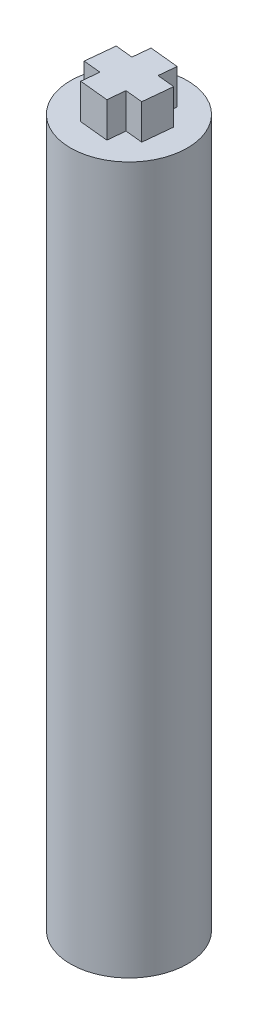
ISO-10303-21;
HEADER;
FILE_DESCRIPTION(('STEP AP214'),'2;1');
FILE_NAME('part.step','',(''),(''),'','','');
FILE_SCHEMA(('AUTOMOTIVE_DESIGN { 1 0 10303 214 1 1 1 1 }'));
ENDSEC;
DATA;
#1=APPLICATION_CONTEXT('core data for automotive mechanical design processes');
#2=APPLICATION_PROTOCOL_DEFINITION('international standard','automotive_design',2000,#1);
#3=PRODUCT_CONTEXT('',#1,'mechanical');
#4=PRODUCT('Part','Part','',(#3));
#5=PRODUCT_RELATED_PRODUCT_CATEGORY('part','',(#4));
#6=PRODUCT_DEFINITION_FORMATION('','',#4);
#7=PRODUCT_DEFINITION_CONTEXT('part definition',#1,'design');
#8=PRODUCT_DEFINITION('design','',#6,#7);
#9=PRODUCT_DEFINITION_SHAPE('','',#8);
#10=(LENGTH_UNIT() NAMED_UNIT(*) SI_UNIT(.MILLI.,.METRE.));
#11=(NAMED_UNIT(*) PLANE_ANGLE_UNIT() SI_UNIT($,.RADIAN.));
#12=(NAMED_UNIT(*) SI_UNIT($,.STERADIAN.) SOLID_ANGLE_UNIT());
#13=UNCERTAINTY_MEASURE_WITH_UNIT(LENGTH_MEASURE(1.E-05),#10,'distance_accuracy_value','');
#14=(GEOMETRIC_REPRESENTATION_CONTEXT(3) GLOBAL_UNCERTAINTY_ASSIGNED_CONTEXT((#13)) GLOBAL_UNIT_ASSIGNED_CONTEXT((#10,
#11,#12)) REPRESENTATION_CONTEXT('',''));
#15=CARTESIAN_POINT('',(0.,0.,0.));
#16=DIRECTION('',(0.,0.,1.));
#17=DIRECTION('',(1.,0.,0.));
#18=AXIS2_PLACEMENT_3D('',#15,#16,#17);
#19=CARTESIAN_POINT('',(0.,0.,0.));
#20=DIRECTION('',(0.,1.,0.));
#21=DIRECTION('',(0.,0.,1.));
#22=AXIS2_PLACEMENT_3D('',#19,#20,#21);
#23=PLANE('',#22);
#24=DIRECTION('',(-0.0952750914858848,0.,0.995450981687374));
#25=VECTOR('',#24,1.);
#26=CARTESIAN_POINT('',(2.88875972386049,0.,-1.3184842020801));
#27=LINE('',#26,#25);
#28=CARTESIAN_POINT('',(2.88875972386049,0.,-1.3184842020801));
#29=VERTEX_POINT('',#28);
#30=CARTESIAN_POINT('',(2.58622067542006,0.,1.84249720525246));
#31=VERTEX_POINT('',#30);
#32=EDGE_CURVE('E280',#29,#31,#27,.T.);
#33=ORIENTED_EDGE('',*,*,#32,.F.);
#34=DIRECTION('',(0.814448292620482,0.,0.58023614041835));
#35=VECTOR('',#34,1.);
#36=CARTESIAN_POINT('',(0.302539048440431,0.,-3.16098140733255));
#37=LINE('',#36,#35);
#38=CARTESIAN_POINT('',(0.302539048440431,0.,-3.16098140733255));
#39=VERTEX_POINT('',#38);
#40=EDGE_CURVE('E278',#39,#29,#37,.T.);
#41=ORIENTED_EDGE('',*,*,#40,.F.);
#42=DIRECTION('',(0.909723384106366,0.,-0.415214841269024));
#43=VECTOR('',#42,1.);
#44=CARTESIAN_POINT('',(-2.58622067542006,0.,-1.84249720525246));
#45=LINE('',#44,#43);
#46=CARTESIAN_POINT('',(-2.58622067542006,0.,-1.84249720525246));
#47=VERTEX_POINT('',#46);
#48=EDGE_CURVE('E292',#47,#39,#45,.T.);
#49=ORIENTED_EDGE('',*,*,#48,.F.);
#50=DIRECTION('',(0.0952750914858847,0.,-0.995450981687374));
#51=VECTOR('',#50,1.);
#52=CARTESIAN_POINT('',(-2.88875972386049,0.,1.31848420208009));
#53=LINE('',#52,#51);
#54=CARTESIAN_POINT('',(-2.88875972386049,0.,1.31848420208009));
#55=VERTEX_POINT('',#54);
#56=EDGE_CURVE('E289',#55,#47,#53,.T.);
#57=ORIENTED_EDGE('',*,*,#56,.F.);
#58=DIRECTION('',(-0.814448292620482,0.,-0.580236140418349));
#59=VECTOR('',#58,1.);
#60=CARTESIAN_POINT('',(-0.302539048440428,0.,3.16098140733255));
#61=LINE('',#60,#59);
#62=CARTESIAN_POINT('',(-0.302539048440428,0.,3.16098140733255));
#63=VERTEX_POINT('',#62);
#64=EDGE_CURVE('E286',#63,#55,#61,.T.);
#65=ORIENTED_EDGE('',*,*,#64,.F.);
#66=DIRECTION('',(-0.909723384106366,0.,0.415214841269024));
#67=VECTOR('',#66,1.);
#68=CARTESIAN_POINT('',(2.58622067542006,0.,1.84249720525246));
#69=LINE('',#68,#67);
#70=EDGE_CURVE('E283',#31,#63,#69,.T.);
#71=ORIENTED_EDGE('',*,*,#70,.F.);
#72=EDGE_LOOP('',(#33,#41,#49,#57,#65,#71));
#73=FACE_BOUND('',#72,.T.);
#74=CARTESIAN_POINT('',(0.,0.,0.));
#75=DIRECTION('',(0.,1.,0.));
#76=DIRECTION('',(0.,0.,1.));
#77=AXIS2_PLACEMENT_3D('',#74,#75,#76);
#78=CIRCLE('',#77,5.);
#79=CARTESIAN_POINT('',(0.,0.,5.));
#80=VERTEX_POINT('',#79);
#81=EDGE_CURVE('E53',#80,#80,#78,.T.);
#82=ORIENTED_EDGE('',*,*,#81,.F.);
#83=EDGE_LOOP('',(#82));
#84=FACE_BOUND('',#83,.T.);
#85=ADVANCED_FACE('F45',(#73,#84),#23,.F.);
#86=CARTESIAN_POINT('',(0.,2.,0.));
#87=DIRECTION('',(0.,-1.,0.));
#88=DIRECTION('',(0.,0.,-1.));
#89=AXIS2_PLACEMENT_3D('',#86,#87,#88);
#90=CYLINDRICAL_SURFACE('',#89,5.);
#91=ORIENTED_EDGE('',*,*,#81,.T.);
#92=EDGE_LOOP('',(#91));
#93=FACE_BOUND('',#92,.T.);
#94=CARTESIAN_POINT('',(0.,60.5,0.));
#95=DIRECTION('',(0.,1.,0.));
#96=DIRECTION('',(0.,0.,1.));
#97=AXIS2_PLACEMENT_3D('',#94,#95,#96);
#98=CIRCLE('',#97,5.);
#99=CARTESIAN_POINT('',(0.,60.5,5.));
#100=VERTEX_POINT('',#99);
#101=EDGE_CURVE('E210',#100,#100,#98,.T.);
#102=ORIENTED_EDGE('',*,*,#101,.F.);
#103=EDGE_LOOP('',(#102));
#104=FACE_BOUND('',#103,.T.);
#105=ADVANCED_FACE('F47',(#93,#104),#90,.T.);
#106=CARTESIAN_POINT('',(0.302539048440431,2.,-3.16098140733255));
#107=DIRECTION('',(0.580236140418349,0.,-0.814448292620481));
#108=DIRECTION('',(-0.814448292620481,0.,-0.580236140418349));
#109=AXIS2_PLACEMENT_3D('',#106,#107,#108);
#110=PLANE('',#109);
#111=ORIENTED_EDGE('',*,*,#40,.T.);
#112=DIRECTION('',(0.,-1.,0.));
#113=VECTOR('',#112,1.);
#114=CARTESIAN_POINT('',(2.88875972386049,2.,-1.3184842020801));
#115=LINE('',#114,#113);
#116=CARTESIAN_POINT('',(2.8887597238605,8.,-1.31848420208007));
#117=VERTEX_POINT('',#116);
#118=EDGE_CURVE('E295',#117,#29,#115,.T.);
#119=ORIENTED_EDGE('',*,*,#118,.F.);
#120=DIRECTION('',(0.814448292620477,0.,0.580236140418356));
#121=VECTOR('',#120,1.);
#122=CARTESIAN_POINT('',(0.302539048440452,8.,-3.16098140733255));
#123=LINE('',#122,#121);
#124=CARTESIAN_POINT('',(0.302539048440452,8.,-3.16098140733255));
#125=VERTEX_POINT('',#124);
#126=EDGE_CURVE('E192',#125,#117,#123,.T.);
#127=ORIENTED_EDGE('',*,*,#126,.F.);
#128=DIRECTION('',(0.,-1.,0.));
#129=VECTOR('',#128,1.);
#130=CARTESIAN_POINT('',(0.302539048440431,2.,-3.16098140733255));
#131=LINE('',#130,#129);
#132=EDGE_CURVE('E296',#125,#39,#131,.T.);
#133=ORIENTED_EDGE('',*,*,#132,.T.);
#134=EDGE_LOOP('',(#111,#119,#127,#133));
#135=FACE_BOUND('',#134,.T.);
#136=ADVANCED_FACE('F341',(#135),#110,.F.);
#137=CARTESIAN_POINT('',(-2.58622067542006,2.,-1.84249720525246));
#138=DIRECTION('',(-0.415214841269024,0.,-0.909723384106366));
#139=DIRECTION('',(-0.909723384106366,0.,0.415214841269024));
#140=AXIS2_PLACEMENT_3D('',#137,#138,#139);
#141=PLANE('',#140);
#142=ORIENTED_EDGE('',*,*,#48,.T.);
#143=ORIENTED_EDGE('',*,*,#132,.F.);
#144=DIRECTION('',(0.909723384106369,0.,-0.415214841269018));
#145=VECTOR('',#144,1.);
#146=CARTESIAN_POINT('',(-2.58622067542005,8.,-1.84249720525248));
#147=LINE('',#146,#145);
#148=CARTESIAN_POINT('',(-2.58622067542005,8.,-1.84249720525248));
#149=VERTEX_POINT('',#148);
#150=EDGE_CURVE('E207',#149,#125,#147,.T.);
#151=ORIENTED_EDGE('',*,*,#150,.F.);
#152=DIRECTION('',(0.,-1.,0.));
#153=VECTOR('',#152,1.);
#154=CARTESIAN_POINT('',(-2.58622067542006,2.,-1.84249720525246));
#155=LINE('',#154,#153);
#156=EDGE_CURVE('E299',#149,#47,#155,.T.);
#157=ORIENTED_EDGE('',*,*,#156,.T.);
#158=EDGE_LOOP('',(#142,#143,#151,#157));
#159=FACE_BOUND('',#158,.T.);
#160=ADVANCED_FACE('F394',(#159),#141,.F.);
#161=CARTESIAN_POINT('',(-2.88875972386049,2.,1.31848420208009));
#162=DIRECTION('',(-0.995450981687374,0.,-0.0952750914858847));
#163=DIRECTION('',(-0.0952750914858847,0.,0.995450981687374));
#164=AXIS2_PLACEMENT_3D('',#161,#162,#163);
#165=PLANE('',#164);
#166=ORIENTED_EDGE('',*,*,#56,.T.);
#167=ORIENTED_EDGE('',*,*,#156,.F.);
#168=DIRECTION('',(0.0952750914858919,0.,-0.995450981687373));
#169=VECTOR('',#168,1.);
#170=CARTESIAN_POINT('',(-2.8887597238605,8.,1.31848420208007));
#171=LINE('',#170,#169);
#172=CARTESIAN_POINT('',(-2.8887597238605,8.,1.31848420208007));
#173=VERTEX_POINT('',#172);
#174=EDGE_CURVE('E204',#173,#149,#171,.T.);
#175=ORIENTED_EDGE('',*,*,#174,.F.);
#176=DIRECTION('',(0.,-1.,0.));
#177=VECTOR('',#176,1.);
#178=CARTESIAN_POINT('',(-2.88875972386049,2.,1.31848420208009));
#179=LINE('',#178,#177);
#180=EDGE_CURVE('E301',#173,#55,#179,.T.);
#181=ORIENTED_EDGE('',*,*,#180,.T.);
#182=EDGE_LOOP('',(#166,#167,#175,#181));
#183=FACE_BOUND('',#182,.T.);
#184=ADVANCED_FACE('F408',(#183),#165,.F.);
#185=CARTESIAN_POINT('',(-0.302539048440428,2.,3.16098140733255));
#186=DIRECTION('',(-0.580236140418349,0.,0.814448292620482));
#187=DIRECTION('',(0.814448292620482,0.,0.580236140418349));
#188=AXIS2_PLACEMENT_3D('',#185,#186,#187);
#189=PLANE('',#188);
#190=ORIENTED_EDGE('',*,*,#64,.T.);
#191=ORIENTED_EDGE('',*,*,#180,.F.);
#192=DIRECTION('',(-0.814448292620477,0.,-0.580236140418356));
#193=VECTOR('',#192,1.);
#194=CARTESIAN_POINT('',(-0.302539048440453,8.,3.16098140733255));
#195=LINE('',#194,#193);
#196=CARTESIAN_POINT('',(-0.302539048440453,8.,3.16098140733255));
#197=VERTEX_POINT('',#196);
#198=EDGE_CURVE('E201',#197,#173,#195,.T.);
#199=ORIENTED_EDGE('',*,*,#198,.F.);
#200=DIRECTION('',(0.,-1.,0.));
#201=VECTOR('',#200,1.);
#202=CARTESIAN_POINT('',(-0.302539048440428,2.,3.16098140733255));
#203=LINE('',#202,#201);
#204=EDGE_CURVE('E303',#197,#63,#203,.T.);
#205=ORIENTED_EDGE('',*,*,#204,.T.);
#206=EDGE_LOOP('',(#190,#191,#199,#205));
#207=FACE_BOUND('',#206,.T.);
#208=ADVANCED_FACE('F404',(#207),#189,.F.);
#209=CARTESIAN_POINT('',(2.58622067542006,2.,1.84249720525246));
#210=DIRECTION('',(0.415214841269024,0.,0.909723384106366));
#211=DIRECTION('',(0.909723384106366,0.,-0.415214841269024));
#212=AXIS2_PLACEMENT_3D('',#209,#210,#211);
#213=PLANE('',#212);
#214=ORIENTED_EDGE('',*,*,#70,.T.);
#215=ORIENTED_EDGE('',*,*,#204,.F.);
#216=DIRECTION('',(-0.909723384106369,0.,0.415214841269018));
#217=VECTOR('',#216,1.);
#218=CARTESIAN_POINT('',(2.58622067542005,8.,1.84249720525248));
#219=LINE('',#218,#217);
#220=CARTESIAN_POINT('',(2.58622067542005,8.,1.84249720525248));
#221=VERTEX_POINT('',#220);
#222=EDGE_CURVE('E198',#221,#197,#219,.T.);
#223=ORIENTED_EDGE('',*,*,#222,.F.);
#224=DIRECTION('',(0.,-1.,0.));
#225=VECTOR('',#224,1.);
#226=CARTESIAN_POINT('',(2.58622067542006,2.,1.84249720525246));
#227=LINE('',#226,#225);
#228=EDGE_CURVE('E305',#221,#31,#227,.T.);
#229=ORIENTED_EDGE('',*,*,#228,.T.);
#230=EDGE_LOOP('',(#214,#215,#223,#229));
#231=FACE_BOUND('',#230,.T.);
#232=ADVANCED_FACE('F400',(#231),#213,.F.);
#233=CARTESIAN_POINT('',(2.88875972386049,2.,-1.3184842020801));
#234=DIRECTION('',(0.995450981687374,0.,0.0952750914858848));
#235=DIRECTION('',(0.0952750914858848,0.,-0.995450981687374));
#236=AXIS2_PLACEMENT_3D('',#233,#234,#235);
#237=PLANE('',#236);
#238=ORIENTED_EDGE('',*,*,#32,.T.);
#239=ORIENTED_EDGE('',*,*,#228,.F.);
#240=DIRECTION('',(-0.0952750914858923,0.,0.995450981687373));
#241=VECTOR('',#240,1.);
#242=CARTESIAN_POINT('',(2.8887597238605,8.,-1.31848420208007));
#243=LINE('',#242,#241);
#244=EDGE_CURVE('E195',#117,#221,#243,.T.);
#245=ORIENTED_EDGE('',*,*,#244,.F.);
#246=ORIENTED_EDGE('',*,*,#118,.T.);
#247=EDGE_LOOP('',(#238,#239,#245,#246));
#248=FACE_BOUND('',#247,.T.);
#249=ADVANCED_FACE('F396',(#248),#237,.F.);
#250=CARTESIAN_POINT('',(0.,60.5,0.));
#251=DIRECTION('',(0.,1.,0.));
#252=DIRECTION('',(0.,0.,1.));
#253=AXIS2_PLACEMENT_3D('',#250,#251,#252);
#254=PLANE('',#253);
#255=DIRECTION('',(0.994982427707565,0.,0.10004983035048));
#256=VECTOR('',#255,1.);
#257=CARTESIAN_POINT('',(-2.6111393882577,60.5,-1.51886506809828));
#258=LINE('',#257,#256);
#259=CARTESIAN_POINT('',(-2.6111393882577,60.5,-1.51886506809828));
#260=VERTEX_POINT('',#259);
#261=CARTESIAN_POINT('',(-1.11866574669637,60.5,-1.36879032257256));
#262=VERTEX_POINT('',#261);
#263=EDGE_CURVE('E12',#260,#262,#258,.T.);
#264=ORIENTED_EDGE('',*,*,#263,.T.);
#265=DIRECTION('',(0.100049830350469,0.,-0.994982427707566));
#266=VECTOR('',#265,1.);
#267=CARTESIAN_POINT('',(-1.09365328910875,60.5,-1.61753592949944));
#268=LINE('',#267,#266);
#269=CARTESIAN_POINT('',(-0.968591001170667,60.5,-2.86126396413389));
#270=VERTEX_POINT('',#269);
#271=EDGE_CURVE('E239',#262,#270,#268,.T.);
#272=ORIENTED_EDGE('',*,*,#271,.T.);
#273=DIRECTION('',(0.994982427707566,0.,0.100049830350469));
#274=VECTOR('',#273,1.);
#275=CARTESIAN_POINT('',(-0.968591001170667,60.5,-2.86126396413389));
#276=LINE('',#275,#274);
#277=CARTESIAN_POINT('',(1.51886506809825,60.5,-2.61113938825772));
#278=VERTEX_POINT('',#277);
#279=EDGE_CURVE('E60',#270,#278,#276,.T.);
#280=ORIENTED_EDGE('',*,*,#279,.T.);
#281=DIRECTION('',(-0.10004983035047,0.,0.994982427707566));
#282=VECTOR('',#281,1.);
#283=CARTESIAN_POINT('',(1.51886506809825,60.5,-2.61113938825772));
#284=LINE('',#283,#282);
#285=CARTESIAN_POINT('',(1.36879032257255,60.5,-1.11866574669637));
#286=VERTEX_POINT('',#285);
#287=EDGE_CURVE('E68',#278,#286,#284,.T.);
#288=ORIENTED_EDGE('',*,*,#287,.T.);
#289=DIRECTION('',(0.994982427707564,0.,0.100049830350493));
#290=VECTOR('',#289,1.);
#291=CARTESIAN_POINT('',(1.61753592949944,60.5,-1.09365328910875));
#292=LINE('',#291,#290);
#293=CARTESIAN_POINT('',(2.8612639641339,60.5,-0.968591001170657));
#294=VERTEX_POINT('',#293);
#295=EDGE_CURVE('E234',#286,#294,#292,.T.);
#296=ORIENTED_EDGE('',*,*,#295,.T.);
#297=DIRECTION('',(-0.100049830350473,0.,0.994982427707566));
#298=VECTOR('',#297,1.);
#299=CARTESIAN_POINT('',(2.8612639641339,60.5,-0.968591001170657));
#300=LINE('',#299,#298);
#301=CARTESIAN_POINT('',(2.61113938825772,60.5,1.51886506809826));
#302=VERTEX_POINT('',#301);
#303=EDGE_CURVE('E231',#294,#302,#300,.T.);
#304=ORIENTED_EDGE('',*,*,#303,.T.);
#305=DIRECTION('',(-0.994982427707566,0.,-0.100049830350473));
#306=VECTOR('',#305,1.);
#307=CARTESIAN_POINT('',(2.61113938825772,60.5,1.51886506809826));
#308=LINE('',#307,#306);
#309=CARTESIAN_POINT('',(1.11866574669637,60.5,1.36879032257255));
#310=VERTEX_POINT('',#309);
#311=EDGE_CURVE('E228',#302,#310,#308,.T.);
#312=ORIENTED_EDGE('',*,*,#311,.T.);
#313=DIRECTION('',(-0.100049830350497,0.,0.994982427707564));
#314=VECTOR('',#313,1.);
#315=CARTESIAN_POINT('',(1.09365328910874,60.5,1.61753592949944));
#316=LINE('',#315,#314);
#317=CARTESIAN_POINT('',(0.968591001170647,60.5,2.8612639641339));
#318=VERTEX_POINT('',#317);
#319=EDGE_CURVE('E225',#310,#318,#316,.T.);
#320=ORIENTED_EDGE('',*,*,#319,.T.);
#321=DIRECTION('',(-0.994982427707566,0.,-0.100049830350476));
#322=VECTOR('',#321,1.);
#323=CARTESIAN_POINT('',(0.968591001170647,60.5,2.8612639641339));
#324=LINE('',#323,#322);
#325=CARTESIAN_POINT('',(-1.51886506809827,60.5,2.61113938825771));
#326=VERTEX_POINT('',#325);
#327=EDGE_CURVE('E222',#318,#326,#324,.T.);
#328=ORIENTED_EDGE('',*,*,#327,.T.);
#329=DIRECTION('',(0.100049830350477,0.,-0.994982427707566));
#330=VECTOR('',#329,1.);
#331=CARTESIAN_POINT('',(-1.51886506809827,60.5,2.61113938825771));
#332=LINE('',#331,#330);
#333=CARTESIAN_POINT('',(-1.36879032257255,60.5,1.11866574669636));
#334=VERTEX_POINT('',#333);
#335=EDGE_CURVE('E219',#326,#334,#332,.T.);
#336=ORIENTED_EDGE('',*,*,#335,.T.);
#337=DIRECTION('',(-0.994982427707563,0.,-0.1000498303505));
#338=VECTOR('',#337,1.);
#339=CARTESIAN_POINT('',(-1.61753592949945,60.5,1.09365328910874));
#340=LINE('',#339,#338);
#341=CARTESIAN_POINT('',(-2.8612639641339,60.5,0.968591001170637));
#342=VERTEX_POINT('',#341);
#343=EDGE_CURVE('E216',#334,#342,#340,.T.);
#344=ORIENTED_EDGE('',*,*,#343,.T.);
#345=DIRECTION('',(0.10004983035048,0.,-0.994982427707565));
#346=VECTOR('',#345,1.);
#347=CARTESIAN_POINT('',(-2.8612639641339,60.5,0.968591001170637));
#348=LINE('',#347,#346);
#349=EDGE_CURVE('E213',#342,#260,#348,.T.);
#350=ORIENTED_EDGE('',*,*,#349,.T.);
#351=EDGE_LOOP('',(#264,#272,#280,#288,#296,#304,#312,#320,#328,#336,#344,#350));
#352=FACE_BOUND('',#351,.T.);
#353=ORIENTED_EDGE('',*,*,#101,.T.);
#354=EDGE_LOOP('',(#353));
#355=FACE_BOUND('',#354,.T.);
#356=ADVANCED_FACE('F399',(#352,#355),#254,.T.);
#357=CARTESIAN_POINT('',(0.,63.5,0.));
#358=DIRECTION('',(0.,1.,0.));
#359=DIRECTION('',(0.,0.,1.));
#360=AXIS2_PLACEMENT_3D('',#357,#358,#359);
#361=PLANE('',#360);
#362=DIRECTION('',(-0.994982427707565,0.,-0.10004983035048));
#363=VECTOR('',#362,1.);
#364=CARTESIAN_POINT('',(-2.6111393882577,63.5,-1.51886506809828));
#365=LINE('',#364,#363);
#366=CARTESIAN_POINT('',(-1.11866574669637,63.5,-1.36879032257256));
#367=VERTEX_POINT('',#366);
#368=CARTESIAN_POINT('',(-2.6111393882577,63.5,-1.51886506809828));
#369=VERTEX_POINT('',#368);
#370=EDGE_CURVE('E242',#367,#369,#365,.T.);
#371=ORIENTED_EDGE('',*,*,#370,.T.);
#372=DIRECTION('',(-0.10004983035048,0.,0.994982427707565));
#373=VECTOR('',#372,1.);
#374=CARTESIAN_POINT('',(-2.8612639641339,63.5,0.968591001170637));
#375=LINE('',#374,#373);
#376=CARTESIAN_POINT('',(-2.8612639641339,63.5,0.968591001170637));
#377=VERTEX_POINT('',#376);
#378=EDGE_CURVE('E245',#369,#377,#375,.T.);
#379=ORIENTED_EDGE('',*,*,#378,.T.);
#380=DIRECTION('',(0.994982427707565,0.,0.100049830350483));
#381=VECTOR('',#380,1.);
#382=CARTESIAN_POINT('',(-1.36879032257255,63.5,1.11866574669636));
#383=LINE('',#382,#381);
#384=CARTESIAN_POINT('',(-1.36879032257255,63.5,1.11866574669636));
#385=VERTEX_POINT('',#384);
#386=EDGE_CURVE('E248',#377,#385,#383,.T.);
#387=ORIENTED_EDGE('',*,*,#386,.T.);
#388=DIRECTION('',(-0.100049830350477,0.,0.994982427707566));
#389=VECTOR('',#388,1.);
#390=CARTESIAN_POINT('',(-1.51886506809827,63.5,2.61113938825771));
#391=LINE('',#390,#389);
#392=CARTESIAN_POINT('',(-1.51886506809827,63.5,2.61113938825771));
#393=VERTEX_POINT('',#392);
#394=EDGE_CURVE('E251',#385,#393,#391,.T.);
#395=ORIENTED_EDGE('',*,*,#394,.T.);
#396=DIRECTION('',(0.994982427707566,0.,0.100049830350476));
#397=VECTOR('',#396,1.);
#398=CARTESIAN_POINT('',(0.968591001170647,63.5,2.8612639641339));
#399=LINE('',#398,#397);
#400=CARTESIAN_POINT('',(0.968591001170647,63.5,2.8612639641339));
#401=VERTEX_POINT('',#400);
#402=EDGE_CURVE('E254',#393,#401,#399,.T.);
#403=ORIENTED_EDGE('',*,*,#402,.T.);
#404=DIRECTION('',(0.100049830350479,0.,-0.994982427707565));
#405=VECTOR('',#404,1.);
#406=CARTESIAN_POINT('',(1.11866574669637,63.5,1.36879032257255));
#407=LINE('',#406,#405);
#408=CARTESIAN_POINT('',(1.11866574669637,63.5,1.36879032257255));
#409=VERTEX_POINT('',#408);
#410=EDGE_CURVE('E257',#401,#409,#407,.T.);
#411=ORIENTED_EDGE('',*,*,#410,.T.);
#412=DIRECTION('',(0.994982427707566,0.,0.100049830350473));
#413=VECTOR('',#412,1.);
#414=CARTESIAN_POINT('',(2.61113938825772,63.5,1.51886506809826));
#415=LINE('',#414,#413);
#416=CARTESIAN_POINT('',(2.61113938825772,63.5,1.51886506809826));
#417=VERTEX_POINT('',#416);
#418=EDGE_CURVE('E260',#409,#417,#415,.T.);
#419=ORIENTED_EDGE('',*,*,#418,.T.);
#420=DIRECTION('',(0.100049830350473,0.,-0.994982427707566));
#421=VECTOR('',#420,1.);
#422=CARTESIAN_POINT('',(2.8612639641339,63.5,-0.968591001170657));
#423=LINE('',#422,#421);
#424=CARTESIAN_POINT('',(2.8612639641339,63.5,-0.968591001170657));
#425=VERTEX_POINT('',#424);
#426=EDGE_CURVE('E263',#417,#425,#423,.T.);
#427=ORIENTED_EDGE('',*,*,#426,.T.);
#428=DIRECTION('',(-0.994982427707566,0.,-0.100049830350476));
#429=VECTOR('',#428,1.);
#430=CARTESIAN_POINT('',(1.36879032257255,63.5,-1.11866574669637));
#431=LINE('',#430,#429);
#432=CARTESIAN_POINT('',(1.36879032257255,63.5,-1.11866574669637));
#433=VERTEX_POINT('',#432);
#434=EDGE_CURVE('E266',#425,#433,#431,.T.);
#435=ORIENTED_EDGE('',*,*,#434,.T.);
#436=DIRECTION('',(0.10004983035047,0.,-0.994982427707566));
#437=VECTOR('',#436,1.);
#438=CARTESIAN_POINT('',(1.51886506809825,63.5,-2.61113938825772));
#439=LINE('',#438,#437);
#440=CARTESIAN_POINT('',(1.51886506809825,63.5,-2.61113938825772));
#441=VERTEX_POINT('',#440);
#442=EDGE_CURVE('E269',#433,#441,#439,.T.);
#443=ORIENTED_EDGE('',*,*,#442,.T.);
#444=DIRECTION('',(-0.994982427707566,0.,-0.100049830350469));
#445=VECTOR('',#444,1.);
#446=CARTESIAN_POINT('',(-0.968591001170667,63.5,-2.86126396413389));
#447=LINE('',#446,#445);
#448=CARTESIAN_POINT('',(-0.968591001170667,63.5,-2.86126396413389));
#449=VERTEX_POINT('',#448);
#450=EDGE_CURVE('E272',#441,#449,#447,.T.);
#451=ORIENTED_EDGE('',*,*,#450,.T.);
#452=DIRECTION('',(-0.10004983035047,0.,0.994982427707566));
#453=VECTOR('',#452,1.);
#454=CARTESIAN_POINT('',(-1.11866574669637,63.5,-1.36879032257256));
#455=LINE('',#454,#453);
#456=EDGE_CURVE('E275',#449,#367,#455,.T.);
#457=ORIENTED_EDGE('',*,*,#456,.T.);
#458=EDGE_LOOP('',(#371,#379,#387,#395,#403,#411,#419,#427,#435,#443,#451,#457));
#459=FACE_BOUND('',#458,.T.);
#460=ADVANCED_FACE('F348',(#459),#361,.T.);
#461=CARTESIAN_POINT('',(-2.6111393882577,2.5,-1.51886506809828));
#462=DIRECTION('',(0.10004983035048,0.,-0.994982427707565));
#463=DIRECTION('',(-0.994982427707565,0.,-0.10004983035048));
#464=AXIS2_PLACEMENT_3D('',#461,#462,#463);
#465=PLANE('',#464);
#466=ORIENTED_EDGE('',*,*,#263,.F.);
#467=DIRECTION('',(0.,1.,0.));
#468=VECTOR('',#467,1.);
#469=CARTESIAN_POINT('',(-2.6111393882577,2.5,-1.51886506809828));
#470=LINE('',#469,#468);
#471=EDGE_CURVE('E329',#260,#369,#470,.T.);
#472=ORIENTED_EDGE('',*,*,#471,.T.);
#473=ORIENTED_EDGE('',*,*,#370,.F.);
#474=DIRECTION('',(0.,1.,0.));
#475=VECTOR('',#474,1.);
#476=CARTESIAN_POINT('',(-1.11866574669637,2.5,-1.36879032257254));
#477=LINE('',#476,#475);
#478=EDGE_CURVE('E298',#262,#367,#477,.T.);
#479=ORIENTED_EDGE('',*,*,#478,.F.);
#480=EDGE_LOOP('',(#466,#472,#473,#479));
#481=FACE_BOUND('',#480,.T.);
#482=ADVANCED_FACE('F344',(#481),#465,.T.);
#483=CARTESIAN_POINT('',(-2.8612639641339,2.5,0.968591001170637));
#484=DIRECTION('',(-0.994982427707565,0.,-0.10004983035048));
#485=DIRECTION('',(-0.10004983035048,0.,0.994982427707565));
#486=AXIS2_PLACEMENT_3D('',#483,#484,#485);
#487=PLANE('',#486);
#488=ORIENTED_EDGE('',*,*,#349,.F.);
#489=DIRECTION('',(0.,1.,0.));
#490=VECTOR('',#489,1.);
#491=CARTESIAN_POINT('',(-2.8612639641339,2.5,0.968591001170637));
#492=LINE('',#491,#490);
#493=EDGE_CURVE('E327',#342,#377,#492,.T.);
#494=ORIENTED_EDGE('',*,*,#493,.T.);
#495=ORIENTED_EDGE('',*,*,#378,.F.);
#496=ORIENTED_EDGE('',*,*,#471,.F.);
#497=EDGE_LOOP('',(#488,#494,#495,#496));
#498=FACE_BOUND('',#497,.T.);
#499=ADVANCED_FACE('F347',(#498),#487,.T.);
#500=CARTESIAN_POINT('',(-1.61753592949945,2.5,1.09365328910874));
#501=DIRECTION('',(-0.1000498303505,0.,0.994982427707563));
#502=DIRECTION('',(0.994982427707563,0.,0.1000498303505));
#503=AXIS2_PLACEMENT_3D('',#500,#501,#502);
#504=PLANE('',#503);
#505=ORIENTED_EDGE('',*,*,#343,.F.);
#506=DIRECTION('',(0.,1.,0.));
#507=VECTOR('',#506,1.);
#508=CARTESIAN_POINT('',(-1.36879032257255,2.5,1.11866574669636));
#509=LINE('',#508,#507);
#510=EDGE_CURVE('E325',#334,#385,#509,.T.);
#511=ORIENTED_EDGE('',*,*,#510,.T.);
#512=ORIENTED_EDGE('',*,*,#386,.F.);
#513=ORIENTED_EDGE('',*,*,#493,.F.);
#514=EDGE_LOOP('',(#505,#511,#512,#513));
#515=FACE_BOUND('',#514,.T.);
#516=ADVANCED_FACE('F352',(#515),#504,.T.);
#517=CARTESIAN_POINT('',(-1.51886506809827,2.5,2.61113938825771));
#518=DIRECTION('',(-0.994982427707566,0.,-0.100049830350477));
#519=DIRECTION('',(-0.100049830350477,0.,0.994982427707566));
#520=AXIS2_PLACEMENT_3D('',#517,#518,#519);
#521=PLANE('',#520);
#522=ORIENTED_EDGE('',*,*,#335,.F.);
#523=DIRECTION('',(0.,1.,0.));
#524=VECTOR('',#523,1.);
#525=CARTESIAN_POINT('',(-1.51886506809827,2.5,2.61113938825771));
#526=LINE('',#525,#524);
#527=EDGE_CURVE('E323',#326,#393,#526,.T.);
#528=ORIENTED_EDGE('',*,*,#527,.T.);
#529=ORIENTED_EDGE('',*,*,#394,.F.);
#530=ORIENTED_EDGE('',*,*,#510,.F.);
#531=EDGE_LOOP('',(#522,#528,#529,#530));
#532=FACE_BOUND('',#531,.T.);
#533=ADVANCED_FACE('F356',(#532),#521,.T.);
#534=CARTESIAN_POINT('',(0.968591001170647,2.5,2.8612639641339));
#535=DIRECTION('',(-0.100049830350476,0.,0.994982427707566));
#536=DIRECTION('',(0.994982427707566,0.,0.100049830350476));
#537=AXIS2_PLACEMENT_3D('',#534,#535,#536);
#538=PLANE('',#537);
#539=ORIENTED_EDGE('',*,*,#327,.F.);
#540=DIRECTION('',(0.,1.,0.));
#541=VECTOR('',#540,1.);
#542=CARTESIAN_POINT('',(0.968591001170647,2.5,2.8612639641339));
#543=LINE('',#542,#541);
#544=EDGE_CURVE('E321',#318,#401,#543,.T.);
#545=ORIENTED_EDGE('',*,*,#544,.T.);
#546=ORIENTED_EDGE('',*,*,#402,.F.);
#547=ORIENTED_EDGE('',*,*,#527,.F.);
#548=EDGE_LOOP('',(#539,#545,#546,#547));
#549=FACE_BOUND('',#548,.T.);
#550=ADVANCED_FACE('F360',(#549),#538,.T.);
#551=CARTESIAN_POINT('',(1.09365328910874,2.5,1.61753592949944));
#552=DIRECTION('',(0.994982427707563,0.,0.100049830350497));
#553=DIRECTION('',(0.100049830350497,0.,-0.994982427707564));
#554=AXIS2_PLACEMENT_3D('',#551,#552,#553);
#555=PLANE('',#554);
#556=ORIENTED_EDGE('',*,*,#319,.F.);
#557=DIRECTION('',(0.,1.,0.));
#558=VECTOR('',#557,1.);
#559=CARTESIAN_POINT('',(1.11866574669637,2.5,1.36879032257255));
#560=LINE('',#559,#558);
#561=EDGE_CURVE('E319',#310,#409,#560,.T.);
#562=ORIENTED_EDGE('',*,*,#561,.T.);
#563=ORIENTED_EDGE('',*,*,#410,.F.);
#564=ORIENTED_EDGE('',*,*,#544,.F.);
#565=EDGE_LOOP('',(#556,#562,#563,#564));
#566=FACE_BOUND('',#565,.T.);
#567=ADVANCED_FACE('F364',(#566),#555,.T.);
#568=CARTESIAN_POINT('',(2.61113938825772,2.5,1.51886506809826));
#569=DIRECTION('',(-0.100049830350473,0.,0.994982427707566));
#570=DIRECTION('',(0.994982427707566,0.,0.100049830350473));
#571=AXIS2_PLACEMENT_3D('',#568,#569,#570);
#572=PLANE('',#571);
#573=ORIENTED_EDGE('',*,*,#311,.F.);
#574=DIRECTION('',(0.,1.,0.));
#575=VECTOR('',#574,1.);
#576=CARTESIAN_POINT('',(2.61113938825772,2.5,1.51886506809826));
#577=LINE('',#576,#575);
#578=EDGE_CURVE('E317',#302,#417,#577,.T.);
#579=ORIENTED_EDGE('',*,*,#578,.T.);
#580=ORIENTED_EDGE('',*,*,#418,.F.);
#581=ORIENTED_EDGE('',*,*,#561,.F.);
#582=EDGE_LOOP('',(#573,#579,#580,#581));
#583=FACE_BOUND('',#582,.T.);
#584=ADVANCED_FACE('F368',(#583),#572,.T.);
#585=CARTESIAN_POINT('',(2.8612639641339,2.5,-0.968591001170657));
#586=DIRECTION('',(0.994982427707566,0.,0.100049830350473));
#587=DIRECTION('',(0.100049830350473,0.,-0.994982427707566));
#588=AXIS2_PLACEMENT_3D('',#585,#586,#587);
#589=PLANE('',#588);
#590=ORIENTED_EDGE('',*,*,#303,.F.);
#591=DIRECTION('',(0.,1.,0.));
#592=VECTOR('',#591,1.);
#593=CARTESIAN_POINT('',(2.8612639641339,2.5,-0.968591001170657));
#594=LINE('',#593,#592);
#595=EDGE_CURVE('E315',#294,#425,#594,.T.);
#596=ORIENTED_EDGE('',*,*,#595,.T.);
#597=ORIENTED_EDGE('',*,*,#426,.F.);
#598=ORIENTED_EDGE('',*,*,#578,.F.);
#599=EDGE_LOOP('',(#590,#596,#597,#598));
#600=FACE_BOUND('',#599,.T.);
#601=ADVANCED_FACE('F372',(#600),#589,.T.);
#602=CARTESIAN_POINT('',(1.61753592949944,2.5,-1.09365328910875));
#603=DIRECTION('',(0.100049830350493,0.,-0.994982427707564));
#604=DIRECTION('',(-0.994982427707564,0.,-0.100049830350493));
#605=AXIS2_PLACEMENT_3D('',#602,#603,#604);
#606=PLANE('',#605);
#607=ORIENTED_EDGE('',*,*,#295,.F.);
#608=DIRECTION('',(0.,1.,0.));
#609=VECTOR('',#608,1.);
#610=CARTESIAN_POINT('',(1.36879032257255,2.5,-1.11866574669637));
#611=LINE('',#610,#609);
#612=EDGE_CURVE('E313',#286,#433,#611,.T.);
#613=ORIENTED_EDGE('',*,*,#612,.T.);
#614=ORIENTED_EDGE('',*,*,#434,.F.);
#615=ORIENTED_EDGE('',*,*,#595,.F.);
#616=EDGE_LOOP('',(#607,#613,#614,#615));
#617=FACE_BOUND('',#616,.T.);
#618=ADVANCED_FACE('F376',(#617),#606,.T.);
#619=CARTESIAN_POINT('',(1.51886506809825,2.5,-2.61113938825772));
#620=DIRECTION('',(0.994982427707566,0.,0.10004983035047));
#621=DIRECTION('',(0.10004983035047,0.,-0.994982427707566));
#622=AXIS2_PLACEMENT_3D('',#619,#620,#621);
#623=PLANE('',#622);
#624=ORIENTED_EDGE('',*,*,#287,.F.);
#625=DIRECTION('',(0.,1.,0.));
#626=VECTOR('',#625,1.);
#627=CARTESIAN_POINT('',(1.51886506809825,2.5,-2.61113938825772));
#628=LINE('',#627,#626);
#629=EDGE_CURVE('E311',#278,#441,#628,.T.);
#630=ORIENTED_EDGE('',*,*,#629,.T.);
#631=ORIENTED_EDGE('',*,*,#442,.F.);
#632=ORIENTED_EDGE('',*,*,#612,.F.);
#633=EDGE_LOOP('',(#624,#630,#631,#632));
#634=FACE_BOUND('',#633,.T.);
#635=ADVANCED_FACE('F380',(#634),#623,.T.);
#636=CARTESIAN_POINT('',(-0.968591001170667,2.5,-2.86126396413389));
#637=DIRECTION('',(0.100049830350469,0.,-0.994982427707566));
#638=DIRECTION('',(-0.994982427707566,0.,-0.100049830350469));
#639=AXIS2_PLACEMENT_3D('',#636,#637,#638);
#640=PLANE('',#639);
#641=ORIENTED_EDGE('',*,*,#279,.F.);
#642=DIRECTION('',(0.,1.,0.));
#643=VECTOR('',#642,1.);
#644=CARTESIAN_POINT('',(-0.968591001170667,2.5,-2.86126396413389));
#645=LINE('',#644,#643);
#646=EDGE_CURVE('E309',#270,#449,#645,.T.);
#647=ORIENTED_EDGE('',*,*,#646,.T.);
#648=ORIENTED_EDGE('',*,*,#450,.F.);
#649=ORIENTED_EDGE('',*,*,#629,.F.);
#650=EDGE_LOOP('',(#641,#647,#648,#649));
#651=FACE_BOUND('',#650,.T.);
#652=ADVANCED_FACE('F384',(#651),#640,.T.);
#653=CARTESIAN_POINT('',(-1.09365328910875,2.5,-1.61753592949944));
#654=DIRECTION('',(-0.994982427707566,0.,-0.100049830350469));
#655=DIRECTION('',(-0.100049830350469,0.,0.994982427707566));
#656=AXIS2_PLACEMENT_3D('',#653,#654,#655);
#657=PLANE('',#656);
#658=ORIENTED_EDGE('',*,*,#271,.F.);
#659=ORIENTED_EDGE('',*,*,#478,.T.);
#660=ORIENTED_EDGE('',*,*,#456,.F.);
#661=ORIENTED_EDGE('',*,*,#646,.F.);
#662=EDGE_LOOP('',(#658,#659,#660,#661));
#663=FACE_BOUND('',#662,.T.);
#664=ADVANCED_FACE('F387',(#663),#657,.T.);
#665=CARTESIAN_POINT('',(0.,8.,0.));
#666=DIRECTION('',(0.,-1.,0.));
#667=DIRECTION('',(0.,0.,-1.));
#668=AXIS2_PLACEMENT_3D('',#665,#666,#667);
#669=PLANE('',#668);
#670=CARTESIAN_POINT('',(0.,8.,0.));
#671=DIRECTION('',(0.,-1.,0.));
#672=DIRECTION('',(0.,0.,-1.));
#673=AXIS2_PLACEMENT_3D('',#670,#671,#672);
#674=CIRCLE('',#673,1.5);
#675=CARTESIAN_POINT('',(0.,8.,-1.5));
#676=VERTEX_POINT('',#675);
#677=EDGE_CURVE('E189',#676,#676,#674,.T.);
#678=ORIENTED_EDGE('',*,*,#677,.F.);
#679=EDGE_LOOP('',(#678));
#680=FACE_BOUND('',#679,.T.);
#681=ORIENTED_EDGE('',*,*,#126,.T.);
#682=ORIENTED_EDGE('',*,*,#244,.T.);
#683=ORIENTED_EDGE('',*,*,#222,.T.);
#684=ORIENTED_EDGE('',*,*,#198,.T.);
#685=ORIENTED_EDGE('',*,*,#174,.T.);
#686=ORIENTED_EDGE('',*,*,#150,.T.);
#687=EDGE_LOOP('',(#681,#682,#683,#684,#685,#686));
#688=FACE_BOUND('',#687,.T.);
#689=ADVANCED_FACE('F390',(#680,#688),#669,.T.);
#690=CARTESIAN_POINT('',(0.,23.,0.));
#691=DIRECTION('',(0.,-1.,0.));
#692=DIRECTION('',(0.,0.,-1.));
#693=AXIS2_PLACEMENT_3D('',#690,#691,#692);
#694=CYLINDRICAL_SURFACE('',#693,1.5);
#695=CARTESIAN_POINT('',(0.,23.,0.));
#696=DIRECTION('',(0.,-1.,0.));
#697=DIRECTION('',(0.,0.,-1.));
#698=AXIS2_PLACEMENT_3D('',#695,#696,#697);
#699=CIRCLE('',#698,1.5);
#700=CARTESIAN_POINT('',(0.,23.,-1.5));
#701=VERTEX_POINT('',#700);
#702=EDGE_CURVE('E184',#701,#701,#699,.F.);
#703=ORIENTED_EDGE('',*,*,#702,.T.);
#704=EDGE_LOOP('',(#703));
#705=FACE_BOUND('',#704,.T.);
#706=ORIENTED_EDGE('',*,*,#677,.T.);
#707=EDGE_LOOP('',(#706));
#708=FACE_BOUND('',#707,.T.);
#709=ADVANCED_FACE('F424',(#705,#708),#694,.F.);
#710=CARTESIAN_POINT('',(0.,23.,0.));
#711=DIRECTION('',(0.,-1.,0.));
#712=DIRECTION('',(0.,0.,-1.));
#713=AXIS2_PLACEMENT_3D('',#710,#711,#712);
#714=PLANE('',#713);
#715=CARTESIAN_POINT('',(0.,23.,0.));
#716=DIRECTION('',(0.,-1.,0.));
#717=DIRECTION('',(0.,0.,-1.));
#718=AXIS2_PLACEMENT_3D('',#715,#716,#717);
#719=CIRCLE('',#718,3.5);
#720=CARTESIAN_POINT('',(0.,23.,-3.5));
#721=VERTEX_POINT('',#720);
#722=EDGE_CURVE('E181',#721,#721,#719,.T.);
#723=ORIENTED_EDGE('',*,*,#722,.F.);
#724=EDGE_LOOP('',(#723));
#725=FACE_BOUND('',#724,.T.);
#726=ORIENTED_EDGE('',*,*,#702,.F.);
#727=EDGE_LOOP('',(#726));
#728=FACE_BOUND('',#727,.T.);
#729=ADVANCED_FACE('F428',(#725,#728),#714,.F.);
#730=CARTESIAN_POINT('',(0.,53.,0.));
#731=DIRECTION('',(0.,-1.,0.));
#732=DIRECTION('',(0.,0.,-1.));
#733=AXIS2_PLACEMENT_3D('',#730,#731,#732);
#734=CYLINDRICAL_SURFACE('',#733,3.5);
#735=CARTESIAN_POINT('',(0.,53.,0.));
#736=DIRECTION('',(0.,1.,0.));
#737=DIRECTION('',(0.,0.,1.));
#738=AXIS2_PLACEMENT_3D('',#735,#736,#737);
#739=CIRCLE('',#738,3.5);
#740=CARTESIAN_POINT('',(0.,53.,3.5));
#741=VERTEX_POINT('',#740);
#742=EDGE_CURVE('E179',#741,#741,#739,.T.);
#743=ORIENTED_EDGE('',*,*,#742,.T.);
#744=EDGE_LOOP('',(#743));
#745=FACE_BOUND('',#744,.T.);
#746=ORIENTED_EDGE('',*,*,#722,.T.);
#747=EDGE_LOOP('',(#746));
#748=FACE_BOUND('',#747,.T.);
#749=ADVANCED_FACE('F175',(#745,#748),#734,.F.);
#750=CARTESIAN_POINT('',(0.,53.,0.));
#751=DIRECTION('',(0.,-1.,0.));
#752=DIRECTION('',(0.,0.,-1.));
#753=AXIS2_PLACEMENT_3D('',#750,#751,#752);
#754=CONICAL_SURFACE('',#753,3.5,0.436627159813541);
#755=CARTESIAN_POINT('',(0.,60.5,0.));
#756=VERTEX_POINT('',#755);
#757=VERTEX_LOOP('',#756);
#758=FACE_BOUND('',#757,.T.);
#759=ORIENTED_EDGE('',*,*,#742,.F.);
#760=EDGE_LOOP('',(#759));
#761=FACE_BOUND('',#760,.T.);
#762=ADVANCED_FACE('F172',(#758,#761),#754,.F.);
#763=CLOSED_SHELL('',(#85,#105,#136,#160,#184,#208,#232,#249,#356,#460,#482,#499,#516,#533,#550,
#567,#584,#601,#618,#635,#652,#664,#689,#709,#729,#749,#762));
#764=MANIFOLD_SOLID_BREP('B2',#763);
#765=ADVANCED_BREP_SHAPE_REPRESENTATION('',(#18,#764),#14);
#766=SHAPE_DEFINITION_REPRESENTATION(#9,#765);
ENDSEC;
END-ISO-10303-21;
